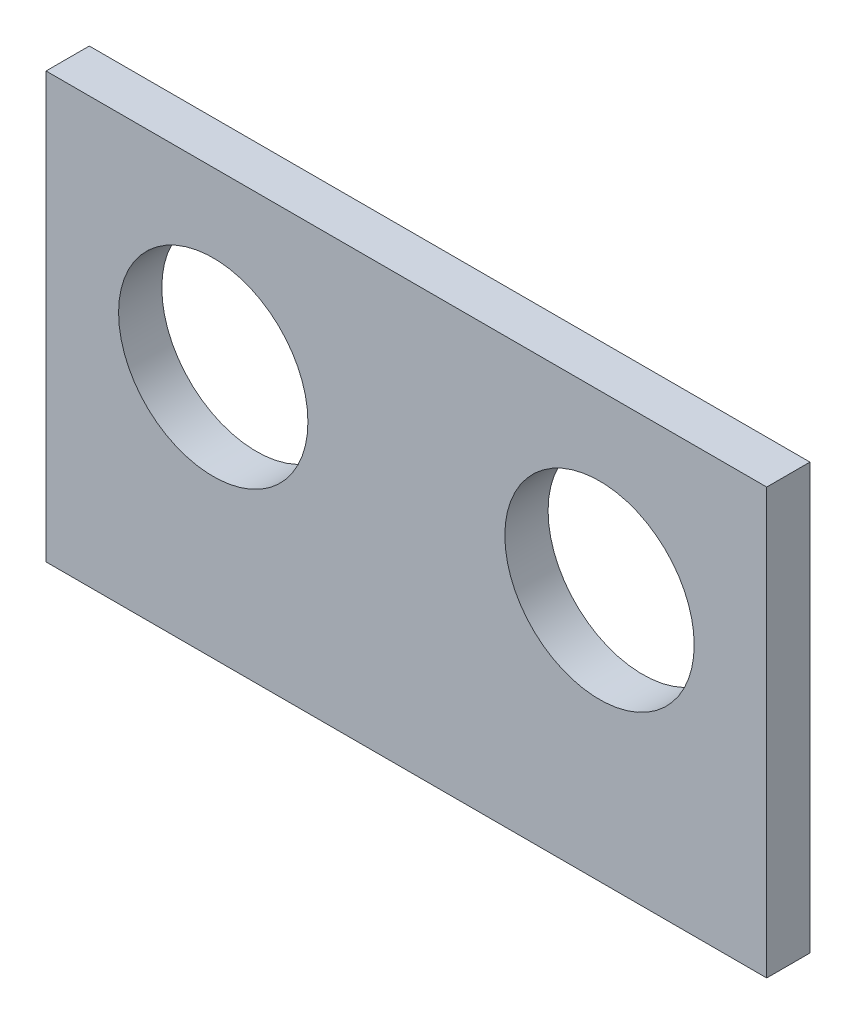
ISO-10303-21;
HEADER;
FILE_DESCRIPTION(('STEP AP214'),'2;1');
FILE_NAME('part.step','',(''),(''),'','','');
FILE_SCHEMA(('AUTOMOTIVE_DESIGN { 1 0 10303 214 1 1 1 1 }'));
ENDSEC;
DATA;
#1=APPLICATION_CONTEXT('core data for automotive mechanical design processes');
#2=APPLICATION_PROTOCOL_DEFINITION('international standard','automotive_design',2000,#1);
#3=PRODUCT_CONTEXT('',#1,'mechanical');
#4=PRODUCT('Part','Part','',(#3));
#5=PRODUCT_RELATED_PRODUCT_CATEGORY('part','',(#4));
#6=PRODUCT_DEFINITION_FORMATION('','',#4);
#7=PRODUCT_DEFINITION_CONTEXT('part definition',#1,'design');
#8=PRODUCT_DEFINITION('design','',#6,#7);
#9=PRODUCT_DEFINITION_SHAPE('','',#8);
#10=(LENGTH_UNIT() NAMED_UNIT(*) SI_UNIT(.MILLI.,.METRE.));
#11=(NAMED_UNIT(*) PLANE_ANGLE_UNIT() SI_UNIT($,.RADIAN.));
#12=(NAMED_UNIT(*) SI_UNIT($,.STERADIAN.) SOLID_ANGLE_UNIT());
#13=UNCERTAINTY_MEASURE_WITH_UNIT(LENGTH_MEASURE(1.E-05),#10,'distance_accuracy_value','');
#14=(GEOMETRIC_REPRESENTATION_CONTEXT(3) GLOBAL_UNCERTAINTY_ASSIGNED_CONTEXT((#13)) GLOBAL_UNIT_ASSIGNED_CONTEXT((#10,
#11,#12)) REPRESENTATION_CONTEXT('',''));
#15=CARTESIAN_POINT('',(0.,0.,0.));
#16=DIRECTION('',(0.,0.,1.));
#17=DIRECTION('',(1.,0.,0.));
#18=AXIS2_PLACEMENT_3D('',#15,#16,#17);
#19=CARTESIAN_POINT('',(12.5,0.,1.5));
#20=DIRECTION('',(-1.,0.,0.));
#21=DIRECTION('',(0.,0.,1.));
#22=AXIS2_PLACEMENT_3D('',#19,#20,#21);
#23=PLANE('',#22);
#24=DIRECTION('',(0.,1.,0.));
#25=VECTOR('',#24,1.);
#26=CARTESIAN_POINT('',(12.5,0.,0.));
#27=LINE('',#26,#25);
#28=CARTESIAN_POINT('',(12.5,-7.375,0.));
#29=VERTEX_POINT('',#28);
#30=CARTESIAN_POINT('',(12.5,7.375,0.));
#31=VERTEX_POINT('',#30);
#32=EDGE_CURVE('E115',#29,#31,#27,.T.);
#33=ORIENTED_EDGE('',*,*,#32,.T.);
#34=DIRECTION('',(0.,0.,-1.));
#35=VECTOR('',#34,1.);
#36=CARTESIAN_POINT('',(12.5,7.375,1.5));
#37=LINE('',#36,#35);
#38=CARTESIAN_POINT('',(12.5,7.375,1.5));
#39=VERTEX_POINT('',#38);
#40=EDGE_CURVE('E11',#39,#31,#37,.T.);
#41=ORIENTED_EDGE('',*,*,#40,.F.);
#42=DIRECTION('',(0.,1.,0.));
#43=VECTOR('',#42,1.);
#44=CARTESIAN_POINT('',(12.5,0.,1.5));
#45=LINE('',#44,#43);
#46=CARTESIAN_POINT('',(12.5,-7.375,1.5));
#47=VERTEX_POINT('',#46);
#48=EDGE_CURVE('E87',#47,#39,#45,.T.);
#49=ORIENTED_EDGE('',*,*,#48,.F.);
#50=DIRECTION('',(0.,0.,-1.));
#51=VECTOR('',#50,1.);
#52=CARTESIAN_POINT('',(12.5,-7.375,1.5));
#53=LINE('',#52,#51);
#54=EDGE_CURVE('E111',#47,#29,#53,.T.);
#55=ORIENTED_EDGE('',*,*,#54,.T.);
#56=EDGE_LOOP('',(#33,#41,#49,#55));
#57=FACE_BOUND('',#56,.T.);
#58=ADVANCED_FACE('F47',(#57),#23,.F.);
#59=CARTESIAN_POINT('',(0.,7.375,1.5));
#60=DIRECTION('',(0.,1.,0.));
#61=DIRECTION('',(-1.,0.,0.));
#62=AXIS2_PLACEMENT_3D('',#59,#60,#61);
#63=PLANE('',#62);
#64=DIRECTION('',(1.,0.,0.));
#65=VECTOR('',#64,1.);
#66=CARTESIAN_POINT('',(0.,7.375,0.));
#67=LINE('',#66,#65);
#68=CARTESIAN_POINT('',(-12.5,7.375,0.));
#69=VERTEX_POINT('',#68);
#70=EDGE_CURVE('E96',#69,#31,#67,.T.);
#71=ORIENTED_EDGE('',*,*,#70,.F.);
#72=DIRECTION('',(0.,0.,-1.));
#73=VECTOR('',#72,1.);
#74=CARTESIAN_POINT('',(-12.5,7.375,1.5));
#75=LINE('',#74,#73);
#76=CARTESIAN_POINT('',(-12.5,7.375,1.5));
#77=VERTEX_POINT('',#76);
#78=EDGE_CURVE('E56',#77,#69,#75,.T.);
#79=ORIENTED_EDGE('',*,*,#78,.F.);
#80=DIRECTION('',(1.,0.,0.));
#81=VECTOR('',#80,1.);
#82=CARTESIAN_POINT('',(0.,7.375,1.5));
#83=LINE('',#82,#81);
#84=EDGE_CURVE('E94',#77,#39,#83,.T.);
#85=ORIENTED_EDGE('',*,*,#84,.T.);
#86=ORIENTED_EDGE('',*,*,#40,.T.);
#87=EDGE_LOOP('',(#71,#79,#85,#86));
#88=FACE_BOUND('',#87,.T.);
#89=ADVANCED_FACE('F93',(#88),#63,.T.);
#90=CARTESIAN_POINT('',(-12.5,0.,1.5));
#91=DIRECTION('',(-1.,0.,0.));
#92=DIRECTION('',(0.,0.,1.));
#93=AXIS2_PLACEMENT_3D('',#90,#91,#92);
#94=PLANE('',#93);
#95=DIRECTION('',(0.,1.,0.));
#96=VECTOR('',#95,1.);
#97=CARTESIAN_POINT('',(-12.5,0.,0.));
#98=LINE('',#97,#96);
#99=CARTESIAN_POINT('',(-12.5,-7.375,0.));
#100=VERTEX_POINT('',#99);
#101=EDGE_CURVE('E122',#100,#69,#98,.T.);
#102=ORIENTED_EDGE('',*,*,#101,.F.);
#103=DIRECTION('',(0.,0.,-1.));
#104=VECTOR('',#103,1.);
#105=CARTESIAN_POINT('',(-12.5,-7.375,1.5));
#106=LINE('',#105,#104);
#107=CARTESIAN_POINT('',(-12.5,-7.375,1.5));
#108=VERTEX_POINT('',#107);
#109=EDGE_CURVE('E79',#108,#100,#106,.T.);
#110=ORIENTED_EDGE('',*,*,#109,.F.);
#111=DIRECTION('',(0.,1.,0.));
#112=VECTOR('',#111,1.);
#113=CARTESIAN_POINT('',(-12.5,0.,1.5));
#114=LINE('',#113,#112);
#115=EDGE_CURVE('E103',#108,#77,#114,.T.);
#116=ORIENTED_EDGE('',*,*,#115,.T.);
#117=ORIENTED_EDGE('',*,*,#78,.T.);
#118=EDGE_LOOP('',(#102,#110,#116,#117));
#119=FACE_BOUND('',#118,.T.);
#120=ADVANCED_FACE('F106',(#119),#94,.T.);
#121=CARTESIAN_POINT('',(0.,-7.375,1.5));
#122=DIRECTION('',(0.,1.,0.));
#123=DIRECTION('',(-1.,0.,0.));
#124=AXIS2_PLACEMENT_3D('',#121,#122,#123);
#125=PLANE('',#124);
#126=DIRECTION('',(1.,0.,0.));
#127=VECTOR('',#126,1.);
#128=CARTESIAN_POINT('',(0.,-7.375,0.));
#129=LINE('',#128,#127);
#130=EDGE_CURVE('E82',#100,#29,#129,.T.);
#131=ORIENTED_EDGE('',*,*,#130,.T.);
#132=ORIENTED_EDGE('',*,*,#54,.F.);
#133=DIRECTION('',(1.,0.,0.));
#134=VECTOR('',#133,1.);
#135=CARTESIAN_POINT('',(0.,-7.375,1.5));
#136=LINE('',#135,#134);
#137=EDGE_CURVE('E64',#108,#47,#136,.T.);
#138=ORIENTED_EDGE('',*,*,#137,.F.);
#139=ORIENTED_EDGE('',*,*,#109,.T.);
#140=EDGE_LOOP('',(#131,#132,#138,#139));
#141=FACE_BOUND('',#140,.T.);
#142=ADVANCED_FACE('F150',(#141),#125,.F.);
#143=CARTESIAN_POINT('',(0.,0.,1.5));
#144=DIRECTION('',(0.,0.,1.));
#145=DIRECTION('',(1.,0.,0.));
#146=AXIS2_PLACEMENT_3D('',#143,#144,#145);
#147=PLANE('',#146);
#148=CARTESIAN_POINT('',(6.7,1.375,1.5));
#149=DIRECTION('',(0.,0.,1.));
#150=DIRECTION('',(1.,0.,0.));
#151=AXIS2_PLACEMENT_3D('',#148,#149,#150);
#152=CIRCLE('',#151,3.28429887089559);
#153=CARTESIAN_POINT('',(9.98429887089559,1.375,1.5));
#154=VERTEX_POINT('',#153);
#155=EDGE_CURVE('E119',#154,#154,#152,.T.);
#156=ORIENTED_EDGE('',*,*,#155,.F.);
#157=EDGE_LOOP('',(#156));
#158=FACE_BOUND('',#157,.T.);
#159=CARTESIAN_POINT('',(-6.7,1.375,1.5));
#160=DIRECTION('',(0.,0.,1.));
#161=DIRECTION('',(1.,0.,0.));
#162=AXIS2_PLACEMENT_3D('',#159,#160,#161);
#163=CIRCLE('',#162,3.28429887089559);
#164=CARTESIAN_POINT('',(-3.41570112910441,1.375,1.5));
#165=VERTEX_POINT('',#164);
#166=EDGE_CURVE('E256',#165,#165,#163,.T.);
#167=ORIENTED_EDGE('',*,*,#166,.F.);
#168=EDGE_LOOP('',(#167));
#169=FACE_BOUND('',#168,.T.);
#170=ORIENTED_EDGE('',*,*,#48,.T.);
#171=ORIENTED_EDGE('',*,*,#84,.F.);
#172=ORIENTED_EDGE('',*,*,#115,.F.);
#173=ORIENTED_EDGE('',*,*,#137,.T.);
#174=EDGE_LOOP('',(#170,#171,#172,#173));
#175=FACE_BOUND('',#174,.T.);
#176=ADVANCED_FACE('F102',(#158,#169,#175),#147,.T.);
#177=CARTESIAN_POINT('',(0.,0.,0.));
#178=DIRECTION('',(0.,0.,1.));
#179=DIRECTION('',(1.,0.,0.));
#180=AXIS2_PLACEMENT_3D('',#177,#178,#179);
#181=PLANE('',#180);
#182=CARTESIAN_POINT('',(6.7,1.375,0.));
#183=DIRECTION('',(0.,0.,-1.));
#184=DIRECTION('',(-1.,0.,0.));
#185=AXIS2_PLACEMENT_3D('',#182,#183,#184);
#186=CIRCLE('',#185,3.28429887089559);
#187=CARTESIAN_POINT('',(3.41570112910442,1.375,0.));
#188=VERTEX_POINT('',#187);
#189=EDGE_CURVE('E254',#188,#188,#186,.T.);
#190=ORIENTED_EDGE('',*,*,#189,.F.);
#191=EDGE_LOOP('',(#190));
#192=FACE_BOUND('',#191,.T.);
#193=CARTESIAN_POINT('',(-6.7,1.375,0.));
#194=DIRECTION('',(0.,0.,-1.));
#195=DIRECTION('',(-1.,0.,0.));
#196=AXIS2_PLACEMENT_3D('',#193,#194,#195);
#197=CIRCLE('',#196,3.28429887089559);
#198=CARTESIAN_POINT('',(-9.98429887089559,1.375,0.));
#199=VERTEX_POINT('',#198);
#200=EDGE_CURVE('E257',#199,#199,#197,.T.);
#201=ORIENTED_EDGE('',*,*,#200,.F.);
#202=EDGE_LOOP('',(#201));
#203=FACE_BOUND('',#202,.T.);
#204=ORIENTED_EDGE('',*,*,#32,.F.);
#205=ORIENTED_EDGE('',*,*,#130,.F.);
#206=ORIENTED_EDGE('',*,*,#101,.T.);
#207=ORIENTED_EDGE('',*,*,#70,.T.);
#208=EDGE_LOOP('',(#204,#205,#206,#207));
#209=FACE_BOUND('',#208,.T.);
#210=ADVANCED_FACE('F138',(#192,#203,#209),#181,.F.);
#211=CARTESIAN_POINT('',(-6.7,1.375,10.));
#212=DIRECTION('',(0.,0.,-1.));
#213=DIRECTION('',(-1.,0.,0.));
#214=AXIS2_PLACEMENT_3D('',#211,#212,#213);
#215=CYLINDRICAL_SURFACE('',#214,3.28429887089559);
#216=ORIENTED_EDGE('',*,*,#166,.T.);
#217=EDGE_LOOP('',(#216));
#218=FACE_BOUND('',#217,.T.);
#219=ORIENTED_EDGE('',*,*,#200,.T.);
#220=EDGE_LOOP('',(#219));
#221=FACE_BOUND('',#220,.T.);
#222=ADVANCED_FACE('F140',(#218,#221),#215,.F.);
#223=CARTESIAN_POINT('',(6.7,1.375,10.));
#224=DIRECTION('',(0.,0.,-1.));
#225=DIRECTION('',(-1.,0.,0.));
#226=AXIS2_PLACEMENT_3D('',#223,#224,#225);
#227=CYLINDRICAL_SURFACE('',#226,3.28429887089559);
#228=ORIENTED_EDGE('',*,*,#155,.T.);
#229=EDGE_LOOP('',(#228));
#230=FACE_BOUND('',#229,.T.);
#231=ORIENTED_EDGE('',*,*,#189,.T.);
#232=EDGE_LOOP('',(#231));
#233=FACE_BOUND('',#232,.T.);
#234=ADVANCED_FACE('F147',(#230,#233),#227,.F.);
#235=CLOSED_SHELL('',(#58,#89,#120,#142,#176,#210,#222,#234));
#236=MANIFOLD_SOLID_BREP('B2',#235);
#237=ADVANCED_BREP_SHAPE_REPRESENTATION('',(#18,#236),#14);
#238=SHAPE_DEFINITION_REPRESENTATION(#9,#237);
ENDSEC;
END-ISO-10303-21;
